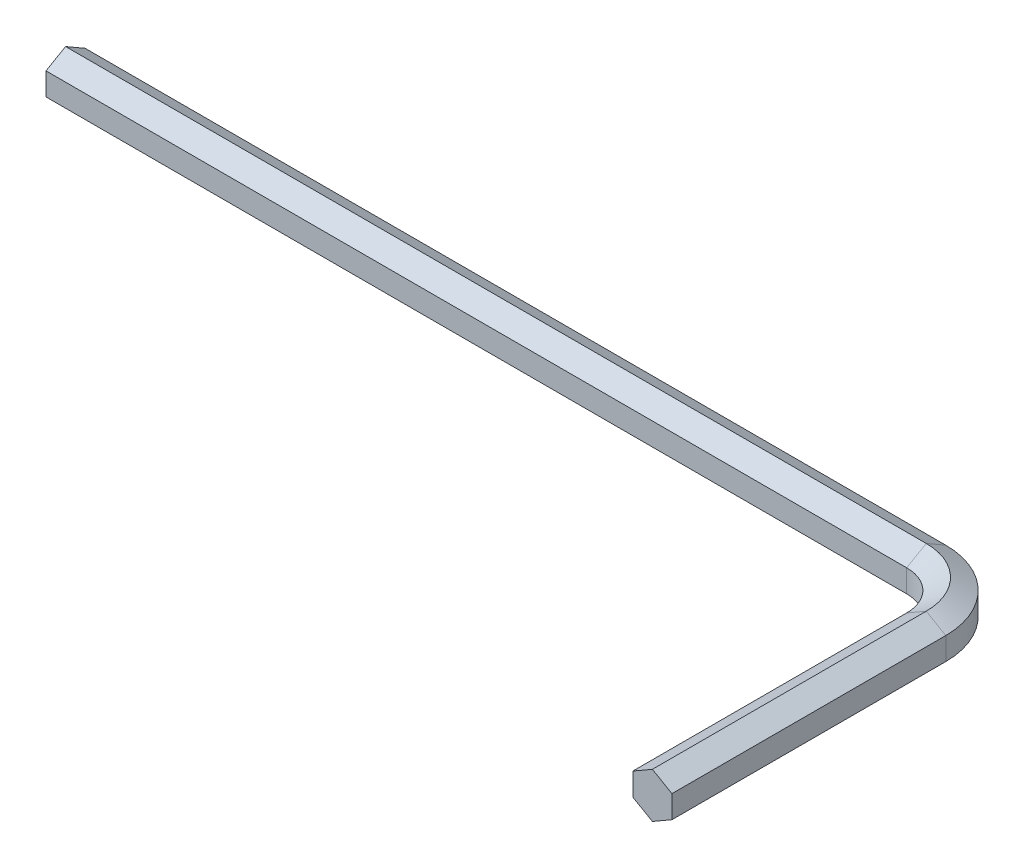
ISO-10303-21;
HEADER;
FILE_DESCRIPTION(('STEP AP214'),'2;1');
FILE_NAME('part.step','',(''),(''),'','','');
FILE_SCHEMA(('AUTOMOTIVE_DESIGN { 1 0 10303 214 1 1 1 1 }'));
ENDSEC;
DATA;
#1=APPLICATION_CONTEXT('core data for automotive mechanical design processes');
#2=APPLICATION_PROTOCOL_DEFINITION('international standard','automotive_design',2000,#1);
#3=PRODUCT_CONTEXT('',#1,'mechanical');
#4=PRODUCT('Part','Part','',(#3));
#5=PRODUCT_RELATED_PRODUCT_CATEGORY('part','',(#4));
#6=PRODUCT_DEFINITION_FORMATION('','',#4);
#7=PRODUCT_DEFINITION_CONTEXT('part definition',#1,'design');
#8=PRODUCT_DEFINITION('design','',#6,#7);
#9=PRODUCT_DEFINITION_SHAPE('','',#8);
#10=(LENGTH_UNIT() NAMED_UNIT(*) SI_UNIT(.MILLI.,.METRE.));
#11=(NAMED_UNIT(*) PLANE_ANGLE_UNIT() SI_UNIT($,.RADIAN.));
#12=(NAMED_UNIT(*) SI_UNIT($,.STERADIAN.) SOLID_ANGLE_UNIT());
#13=UNCERTAINTY_MEASURE_WITH_UNIT(LENGTH_MEASURE(1.E-05),#10,'distance_accuracy_value','');
#14=(GEOMETRIC_REPRESENTATION_CONTEXT(3) GLOBAL_UNCERTAINTY_ASSIGNED_CONTEXT((#13)) GLOBAL_UNIT_ASSIGNED_CONTEXT((#10,
#11,#12)) REPRESENTATION_CONTEXT('',''));
#15=CARTESIAN_POINT('',(0.,0.,0.));
#16=DIRECTION('',(0.,0.,1.));
#17=DIRECTION('',(1.,0.,0.));
#18=AXIS2_PLACEMENT_3D('',#15,#16,#17);
#19=CARTESIAN_POINT('',(0.,0.,0.));
#20=DIRECTION('',(0.,0.,1.));
#21=DIRECTION('',(1.,0.,0.));
#22=AXIS2_PLACEMENT_3D('',#19,#20,#21);
#23=PLANE('',#22);
#24=DIRECTION('',(-0.866025403784442,0.499999999999995,0.));
#25=VECTOR('',#24,1.);
#26=CARTESIAN_POINT('',(0.999999999999994,0.577350269189638,0.));
#27=LINE('',#26,#25);
#28=CARTESIAN_POINT('',(0.999999999999994,0.577350269189638,0.));
#29=VERTEX_POINT('',#28);
#30=CARTESIAN_POINT('',(0.,1.15470053837925,0.));
#31=VERTEX_POINT('',#30);
#32=EDGE_CURVE('E200',#29,#31,#27,.T.);
#33=ORIENTED_EDGE('',*,*,#32,.T.);
#34=DIRECTION('',(-0.866025403784438,-0.500000000000001,0.));
#35=VECTOR('',#34,1.);
#36=CARTESIAN_POINT('',(0.,1.15470053837925,0.));
#37=LINE('',#36,#35);
#38=CARTESIAN_POINT('',(-1.,0.577350269189624,0.));
#39=VERTEX_POINT('',#38);
#40=EDGE_CURVE('E154',#31,#39,#37,.T.);
#41=ORIENTED_EDGE('',*,*,#40,.T.);
#42=DIRECTION('',(0.,-1.,0.));
#43=VECTOR('',#42,1.);
#44=CARTESIAN_POINT('',(-1.,0.577350269189624,0.));
#45=LINE('',#44,#43);
#46=CARTESIAN_POINT('',(-0.999999999999998,-0.577350269189631,0.));
#47=VERTEX_POINT('',#46);
#48=EDGE_CURVE('E146',#39,#47,#45,.T.);
#49=ORIENTED_EDGE('',*,*,#48,.T.);
#50=DIRECTION('',(0.866025403784442,-0.499999999999995,0.));
#51=VECTOR('',#50,1.);
#52=CARTESIAN_POINT('',(-0.999999999999998,-0.577350269189631,0.));
#53=LINE('',#52,#51);
#54=CARTESIAN_POINT('',(0.,-1.15470053837925,0.));
#55=VERTEX_POINT('',#54);
#56=EDGE_CURVE('E139',#47,#55,#53,.T.);
#57=ORIENTED_EDGE('',*,*,#56,.T.);
#58=DIRECTION('',(0.866025403784435,0.500000000000007,0.));
#59=VECTOR('',#58,1.);
#60=CARTESIAN_POINT('',(0.,-1.15470053837925,0.));
#61=LINE('',#60,#59);
#62=CARTESIAN_POINT('',(1.00000000000001,-0.577350269189617,0.));
#63=VERTEX_POINT('',#62);
#64=EDGE_CURVE('E238',#55,#63,#61,.T.);
#65=ORIENTED_EDGE('',*,*,#64,.T.);
#66=DIRECTION('',(0.,1.,0.));
#67=VECTOR('',#66,1.);
#68=CARTESIAN_POINT('',(1.00000000000001,-0.577350269189617,0.));
#69=LINE('',#68,#67);
#70=EDGE_CURVE('E259',#63,#29,#69,.T.);
#71=ORIENTED_EDGE('',*,*,#70,.T.);
#72=EDGE_LOOP('',(#33,#41,#49,#57,#65,#71));
#73=FACE_BOUND('',#72,.T.);
#74=ADVANCED_FACE('F39',(#73),#23,.T.);
#75=CARTESIAN_POINT('',(-47.,0.,-17.));
#76=DIRECTION('',(1.,0.,0.));
#77=DIRECTION('',(0.,0.,-1.));
#78=AXIS2_PLACEMENT_3D('',#75,#76,#77);
#79=PLANE('',#78);
#80=DIRECTION('',(0.,0.499999999999995,0.866025403784442));
#81=VECTOR('',#80,1.);
#82=CARTESIAN_POINT('',(-47.,0.577350269189638,-18.));
#83=LINE('',#82,#81);
#84=CARTESIAN_POINT('',(-47.,0.577350269189638,-18.));
#85=VERTEX_POINT('',#84);
#86=CARTESIAN_POINT('',(-47.,1.15470053837925,-17.));
#87=VERTEX_POINT('',#86);
#88=EDGE_CURVE('E168',#85,#87,#83,.T.);
#89=ORIENTED_EDGE('',*,*,#88,.F.);
#90=DIRECTION('',(0.,1.,0.));
#91=VECTOR('',#90,1.);
#92=CARTESIAN_POINT('',(-47.,-0.577350269189617,-18.));
#93=LINE('',#92,#91);
#94=CARTESIAN_POINT('',(-47.,-0.577350269189617,-18.));
#95=VERTEX_POINT('',#94);
#96=EDGE_CURVE('E11',#95,#85,#93,.T.);
#97=ORIENTED_EDGE('',*,*,#96,.F.);
#98=DIRECTION('',(0.,0.500000000000007,-0.866025403784435));
#99=VECTOR('',#98,1.);
#100=CARTESIAN_POINT('',(-47.,-1.15470053837925,-17.));
#101=LINE('',#100,#99);
#102=CARTESIAN_POINT('',(-47.,-1.15470053837925,-17.));
#103=VERTEX_POINT('',#102);
#104=EDGE_CURVE('E54',#103,#95,#101,.T.);
#105=ORIENTED_EDGE('',*,*,#104,.F.);
#106=DIRECTION('',(0.,-0.499999999999995,-0.866025403784442));
#107=VECTOR('',#106,1.);
#108=CARTESIAN_POINT('',(-47.,-0.577350269189631,-16.));
#109=LINE('',#108,#107);
#110=CARTESIAN_POINT('',(-47.,-0.577350269189631,-16.));
#111=VERTEX_POINT('',#110);
#112=EDGE_CURVE('E63',#111,#103,#109,.T.);
#113=ORIENTED_EDGE('',*,*,#112,.F.);
#114=DIRECTION('',(0.,-1.,0.));
#115=VECTOR('',#114,1.);
#116=CARTESIAN_POINT('',(-47.,0.577350269189624,-16.));
#117=LINE('',#116,#115);
#118=CARTESIAN_POINT('',(-47.,0.577350269189624,-16.));
#119=VERTEX_POINT('',#118);
#120=EDGE_CURVE('E182',#119,#111,#117,.T.);
#121=ORIENTED_EDGE('',*,*,#120,.F.);
#122=DIRECTION('',(0.,-0.500000000000001,0.866025403784438));
#123=VECTOR('',#122,1.);
#124=CARTESIAN_POINT('',(-47.,1.15470053837925,-17.));
#125=LINE('',#124,#123);
#126=EDGE_CURVE('E180',#87,#119,#125,.T.);
#127=ORIENTED_EDGE('',*,*,#126,.F.);
#128=EDGE_LOOP('',(#89,#97,#105,#113,#121,#127));
#129=FACE_BOUND('',#128,.T.);
#130=ADVANCED_FACE('F181',(#129),#79,.F.);
#131=CARTESIAN_POINT('',(0.999999999999994,0.577350269189638,0.));
#132=DIRECTION('',(-0.499999999999995,-0.866025403784442,0.));
#133=DIRECTION('',(0.866025403784442,-0.499999999999995,0.));
#134=AXIS2_PLACEMENT_3D('',#131,#132,#133);
#135=PLANE('',#134);
#136=DIRECTION('',(0.,0.,-1.));
#137=VECTOR('',#136,1.);
#138=CARTESIAN_POINT('',(0.,1.15470053837925,0.));
#139=LINE('',#138,#137);
#140=CARTESIAN_POINT('',(0.,1.15470053837925,-14.));
#141=VERTEX_POINT('',#140);
#142=EDGE_CURVE('E206',#31,#141,#139,.T.);
#143=ORIENTED_EDGE('',*,*,#142,.F.);
#144=ORIENTED_EDGE('',*,*,#32,.F.);
#145=DIRECTION('',(0.,0.,-1.));
#146=VECTOR('',#145,1.);
#147=CARTESIAN_POINT('',(0.999999999999994,0.577350269189638,0.));
#148=LINE('',#147,#146);
#149=CARTESIAN_POINT('',(0.999999999999994,0.577350269189638,-14.));
#150=VERTEX_POINT('',#149);
#151=EDGE_CURVE('E282',#29,#150,#148,.T.);
#152=ORIENTED_EDGE('',*,*,#151,.T.);
#153=DIRECTION('',(-0.866025403784442,0.499999999999995,0.));
#154=VECTOR('',#153,1.);
#155=CARTESIAN_POINT('',(0.999999999999994,0.577350269189638,-14.));
#156=LINE('',#155,#154);
#157=EDGE_CURVE('E301',#150,#141,#156,.T.);
#158=ORIENTED_EDGE('',*,*,#157,.T.);
#159=EDGE_LOOP('',(#143,#144,#152,#158));
#160=FACE_BOUND('',#159,.T.);
#161=ADVANCED_FACE('F318',(#160),#135,.F.);
#162=CARTESIAN_POINT('',(0.,1.15470053837925,0.));
#163=DIRECTION('',(0.500000000000001,-0.866025403784438,0.));
#164=DIRECTION('',(0.866025403784438,0.500000000000001,0.));
#165=AXIS2_PLACEMENT_3D('',#162,#163,#164);
#166=PLANE('',#165);
#167=DIRECTION('',(0.,0.,-1.));
#168=VECTOR('',#167,1.);
#169=CARTESIAN_POINT('',(-1.,0.577350269189624,0.));
#170=LINE('',#169,#168);
#171=CARTESIAN_POINT('',(-1.,0.577350269189624,-14.));
#172=VERTEX_POINT('',#171);
#173=EDGE_CURVE('E205',#39,#172,#170,.T.);
#174=ORIENTED_EDGE('',*,*,#173,.F.);
#175=ORIENTED_EDGE('',*,*,#40,.F.);
#176=ORIENTED_EDGE('',*,*,#142,.T.);
#177=DIRECTION('',(-0.866025403784438,-0.500000000000001,0.));
#178=VECTOR('',#177,1.);
#179=CARTESIAN_POINT('',(0.,1.15470053837925,-14.));
#180=LINE('',#179,#178);
#181=EDGE_CURVE('E201',#141,#172,#180,.T.);
#182=ORIENTED_EDGE('',*,*,#181,.T.);
#183=EDGE_LOOP('',(#174,#175,#176,#182));
#184=FACE_BOUND('',#183,.T.);
#185=ADVANCED_FACE('F319',(#184),#166,.F.);
#186=CARTESIAN_POINT('',(-1.,0.577350269189624,0.));
#187=DIRECTION('',(1.,0.,0.));
#188=DIRECTION('',(0.,1.,0.));
#189=AXIS2_PLACEMENT_3D('',#186,#187,#188);
#190=PLANE('',#189);
#191=DIRECTION('',(0.,0.,-1.));
#192=VECTOR('',#191,1.);
#193=CARTESIAN_POINT('',(-0.999999999999998,-0.577350269189631,0.));
#194=LINE('',#193,#192);
#195=CARTESIAN_POINT('',(-0.999999999999998,-0.577350269189631,-14.));
#196=VERTEX_POINT('',#195);
#197=EDGE_CURVE('E223',#47,#196,#194,.T.);
#198=ORIENTED_EDGE('',*,*,#197,.F.);
#199=ORIENTED_EDGE('',*,*,#48,.F.);
#200=ORIENTED_EDGE('',*,*,#173,.T.);
#201=DIRECTION('',(0.,-1.,0.));
#202=VECTOR('',#201,1.);
#203=CARTESIAN_POINT('',(-1.,0.577350269189624,-14.));
#204=LINE('',#203,#202);
#205=EDGE_CURVE('E209',#172,#196,#204,.T.);
#206=ORIENTED_EDGE('',*,*,#205,.T.);
#207=EDGE_LOOP('',(#198,#199,#200,#206));
#208=FACE_BOUND('',#207,.T.);
#209=ADVANCED_FACE('F372',(#208),#190,.F.);
#210=CARTESIAN_POINT('',(-0.999999999999998,-0.577350269189631,0.));
#211=DIRECTION('',(0.499999999999995,0.866025403784442,0.));
#212=DIRECTION('',(-0.866025403784442,0.499999999999995,0.));
#213=AXIS2_PLACEMENT_3D('',#210,#211,#212);
#214=PLANE('',#213);
#215=DIRECTION('',(0.,0.,-1.));
#216=VECTOR('',#215,1.);
#217=CARTESIAN_POINT('',(0.,-1.15470053837925,0.));
#218=LINE('',#217,#216);
#219=CARTESIAN_POINT('',(0.,-1.15470053837925,-14.));
#220=VERTEX_POINT('',#219);
#221=EDGE_CURVE('E242',#55,#220,#218,.T.);
#222=ORIENTED_EDGE('',*,*,#221,.F.);
#223=ORIENTED_EDGE('',*,*,#56,.F.);
#224=ORIENTED_EDGE('',*,*,#197,.T.);
#225=DIRECTION('',(0.866025403784442,-0.499999999999995,0.));
#226=VECTOR('',#225,1.);
#227=CARTESIAN_POINT('',(-0.999999999999998,-0.577350269189631,-14.));
#228=LINE('',#227,#226);
#229=EDGE_CURVE('E226',#196,#220,#228,.T.);
#230=ORIENTED_EDGE('',*,*,#229,.T.);
#231=EDGE_LOOP('',(#222,#223,#224,#230));
#232=FACE_BOUND('',#231,.T.);
#233=ADVANCED_FACE('F380',(#232),#214,.F.);
#234=CARTESIAN_POINT('',(0.,-1.15470053837925,0.));
#235=DIRECTION('',(-0.500000000000007,0.866025403784435,0.));
#236=DIRECTION('',(-0.866025403784434,-0.500000000000007,0.));
#237=AXIS2_PLACEMENT_3D('',#234,#235,#236);
#238=PLANE('',#237);
#239=DIRECTION('',(0.,0.,-1.));
#240=VECTOR('',#239,1.);
#241=CARTESIAN_POINT('',(1.00000000000001,-0.577350269189617,0.));
#242=LINE('',#241,#240);
#243=CARTESIAN_POINT('',(1.00000000000001,-0.577350269189617,-14.));
#244=VERTEX_POINT('',#243);
#245=EDGE_CURVE('E263',#63,#244,#242,.T.);
#246=ORIENTED_EDGE('',*,*,#245,.F.);
#247=ORIENTED_EDGE('',*,*,#64,.F.);
#248=ORIENTED_EDGE('',*,*,#221,.T.);
#249=DIRECTION('',(0.866025403784435,0.500000000000007,0.));
#250=VECTOR('',#249,1.);
#251=CARTESIAN_POINT('',(0.,-1.15470053837925,-14.));
#252=LINE('',#251,#250);
#253=EDGE_CURVE('E246',#220,#244,#252,.T.);
#254=ORIENTED_EDGE('',*,*,#253,.T.);
#255=EDGE_LOOP('',(#246,#247,#248,#254));
#256=FACE_BOUND('',#255,.T.);
#257=ADVANCED_FACE('F389',(#256),#238,.F.);
#258=CARTESIAN_POINT('',(1.00000000000001,-0.577350269189617,0.));
#259=DIRECTION('',(-1.,0.,0.));
#260=DIRECTION('',(0.,-1.,0.));
#261=AXIS2_PLACEMENT_3D('',#258,#259,#260);
#262=PLANE('',#261);
#263=DIRECTION('',(0.,1.,0.));
#264=VECTOR('',#263,1.);
#265=CARTESIAN_POINT('',(1.00000000000001,-0.577350269189617,-14.));
#266=LINE('',#265,#264);
#267=EDGE_CURVE('E267',#244,#150,#266,.T.);
#268=ORIENTED_EDGE('',*,*,#267,.T.);
#269=ORIENTED_EDGE('',*,*,#151,.F.);
#270=ORIENTED_EDGE('',*,*,#70,.F.);
#271=ORIENTED_EDGE('',*,*,#245,.T.);
#272=EDGE_LOOP('',(#268,#269,#270,#271));
#273=FACE_BOUND('',#272,.T.);
#274=ADVANCED_FACE('F330',(#273),#262,.F.);
#275=CARTESIAN_POINT('',(-3.,0.577350269189638,-14.));
#276=DIRECTION('',(0.,-1.,0.));
#277=DIRECTION('',(0.,0.,-1.));
#278=AXIS2_PLACEMENT_3D('',#275,#276,#277);
#279=CONICAL_SURFACE('',#278,3.99999999999999,1.0471975511966);
#280=CARTESIAN_POINT('',(-3.,1.15470053837925,-14.));
#281=DIRECTION('',(0.,1.,0.));
#282=DIRECTION('',(1.,0.,0.));
#283=AXIS2_PLACEMENT_3D('',#280,#281,#282);
#284=CIRCLE('',#283,3.);
#285=CARTESIAN_POINT('',(-3.00000000000002,1.15470053837925,-17.));
#286=VERTEX_POINT('',#285);
#287=EDGE_CURVE('E212',#141,#286,#284,.T.);
#288=ORIENTED_EDGE('',*,*,#287,.F.);
#289=ORIENTED_EDGE('',*,*,#157,.F.);
#290=CARTESIAN_POINT('',(-3.,0.577350269189638,-14.));
#291=DIRECTION('',(0.,1.,0.));
#292=DIRECTION('',(1.,0.,0.));
#293=AXIS2_PLACEMENT_3D('',#290,#291,#292);
#294=CIRCLE('',#293,3.99999999999999);
#295=CARTESIAN_POINT('',(-3.00000000000003,0.577350269189638,-18.));
#296=VERTEX_POINT('',#295);
#297=EDGE_CURVE('E285',#150,#296,#294,.T.);
#298=ORIENTED_EDGE('',*,*,#297,.T.);
#299=DIRECTION('',(0.,0.499999999999995,0.866025403784442));
#300=VECTOR('',#299,1.);
#301=CARTESIAN_POINT('',(-3.00000000000003,0.577350269189638,-18.));
#302=LINE('',#301,#300);
#303=EDGE_CURVE('E294',#296,#286,#302,.T.);
#304=ORIENTED_EDGE('',*,*,#303,.T.);
#305=EDGE_LOOP('',(#288,#289,#298,#304));
#306=FACE_BOUND('',#305,.T.);
#307=ADVANCED_FACE('F299',(#306),#279,.T.);
#308=CARTESIAN_POINT('',(-3.,1.15470053837925,-14.));
#309=DIRECTION('',(0.,1.,0.));
#310=DIRECTION('',(0.,0.,1.));
#311=AXIS2_PLACEMENT_3D('',#308,#309,#310);
#312=CONICAL_SURFACE('',#311,3.,1.0471975511966);
#313=CARTESIAN_POINT('',(-3.,0.577350269189624,-14.));
#314=DIRECTION('',(0.,1.,0.));
#315=DIRECTION('',(1.,0.,0.));
#316=AXIS2_PLACEMENT_3D('',#313,#314,#315);
#317=CIRCLE('',#316,2.);
#318=CARTESIAN_POINT('',(-3.00000000000001,0.577350269189624,-16.));
#319=VERTEX_POINT('',#318);
#320=EDGE_CURVE('E126',#172,#319,#317,.T.);
#321=ORIENTED_EDGE('',*,*,#320,.F.);
#322=ORIENTED_EDGE('',*,*,#181,.F.);
#323=ORIENTED_EDGE('',*,*,#287,.T.);
#324=DIRECTION('',(0.,-0.500000000000001,0.866025403784438));
#325=VECTOR('',#324,1.);
#326=CARTESIAN_POINT('',(-3.00000000000002,1.15470053837925,-17.));
#327=LINE('',#326,#325);
#328=EDGE_CURVE('E189',#286,#319,#327,.T.);
#329=ORIENTED_EDGE('',*,*,#328,.T.);
#330=EDGE_LOOP('',(#321,#322,#323,#329));
#331=FACE_BOUND('',#330,.T.);
#332=ADVANCED_FACE('F320',(#331),#312,.F.);
#333=CARTESIAN_POINT('',(-3.,0.,-14.));
#334=DIRECTION('',(0.,1.,0.));
#335=DIRECTION('',(0.,0.,1.));
#336=AXIS2_PLACEMENT_3D('',#333,#334,#335);
#337=CYLINDRICAL_SURFACE('',#336,2.);
#338=CARTESIAN_POINT('',(-3.,-0.577350269189631,-14.));
#339=DIRECTION('',(0.,1.,0.));
#340=DIRECTION('',(1.,0.,0.));
#341=AXIS2_PLACEMENT_3D('',#338,#339,#340);
#342=CIRCLE('',#341,2.);
#343=CARTESIAN_POINT('',(-3.00000000000001,-0.577350269189631,-16.));
#344=VERTEX_POINT('',#343);
#345=EDGE_CURVE('E118',#196,#344,#342,.T.);
#346=ORIENTED_EDGE('',*,*,#345,.F.);
#347=ORIENTED_EDGE('',*,*,#205,.F.);
#348=ORIENTED_EDGE('',*,*,#320,.T.);
#349=DIRECTION('',(0.,-1.,0.));
#350=VECTOR('',#349,1.);
#351=CARTESIAN_POINT('',(-3.00000000000001,0.577350269189624,-16.));
#352=LINE('',#351,#350);
#353=EDGE_CURVE('E214',#319,#344,#352,.T.);
#354=ORIENTED_EDGE('',*,*,#353,.T.);
#355=EDGE_LOOP('',(#346,#347,#348,#354));
#356=FACE_BOUND('',#355,.T.);
#357=ADVANCED_FACE('F322',(#356),#337,.F.);
#358=CARTESIAN_POINT('',(-3.,-0.577350269189631,-14.));
#359=DIRECTION('',(0.,-1.,0.));
#360=DIRECTION('',(0.,0.,-1.));
#361=AXIS2_PLACEMENT_3D('',#358,#359,#360);
#362=CONICAL_SURFACE('',#361,2.,1.0471975511966);
#363=CARTESIAN_POINT('',(-3.,-1.15470053837925,-14.));
#364=DIRECTION('',(0.,1.,0.));
#365=DIRECTION('',(1.,0.,0.));
#366=AXIS2_PLACEMENT_3D('',#363,#364,#365);
#367=CIRCLE('',#366,3.00000000000001);
#368=CARTESIAN_POINT('',(-3.00000000000002,-1.15470053837925,-17.));
#369=VERTEX_POINT('',#368);
#370=EDGE_CURVE('E110',#220,#369,#367,.T.);
#371=ORIENTED_EDGE('',*,*,#370,.F.);
#372=ORIENTED_EDGE('',*,*,#229,.F.);
#373=ORIENTED_EDGE('',*,*,#345,.T.);
#374=DIRECTION('',(0.,-0.499999999999995,-0.866025403784442));
#375=VECTOR('',#374,1.);
#376=CARTESIAN_POINT('',(-3.00000000000001,-0.577350269189631,-16.));
#377=LINE('',#376,#375);
#378=EDGE_CURVE('E231',#344,#369,#377,.T.);
#379=ORIENTED_EDGE('',*,*,#378,.T.);
#380=EDGE_LOOP('',(#371,#372,#373,#379));
#381=FACE_BOUND('',#380,.T.);
#382=ADVANCED_FACE('F328',(#381),#362,.F.);
#383=CARTESIAN_POINT('',(-3.,-1.15470053837925,-14.));
#384=DIRECTION('',(0.,1.,0.));
#385=DIRECTION('',(0.,0.,1.));
#386=AXIS2_PLACEMENT_3D('',#383,#384,#385);
#387=CONICAL_SURFACE('',#386,3.00000000000001,1.04719755119659);
#388=CARTESIAN_POINT('',(-3.,-0.577350269189617,-14.));
#389=DIRECTION('',(0.,1.,0.));
#390=DIRECTION('',(1.,0.,0.));
#391=AXIS2_PLACEMENT_3D('',#388,#389,#390);
#392=CIRCLE('',#391,4.00000000000001);
#393=CARTESIAN_POINT('',(-3.00000000000003,-0.577350269189617,-18.));
#394=VERTEX_POINT('',#393);
#395=EDGE_CURVE('E271',#244,#394,#392,.T.);
#396=ORIENTED_EDGE('',*,*,#395,.F.);
#397=ORIENTED_EDGE('',*,*,#253,.F.);
#398=ORIENTED_EDGE('',*,*,#370,.T.);
#399=DIRECTION('',(0.,0.500000000000007,-0.866025403784435));
#400=VECTOR('',#399,1.);
#401=CARTESIAN_POINT('',(-3.00000000000002,-1.15470053837925,-17.));
#402=LINE('',#401,#400);
#403=EDGE_CURVE('E251',#369,#394,#402,.T.);
#404=ORIENTED_EDGE('',*,*,#403,.T.);
#405=EDGE_LOOP('',(#396,#397,#398,#404));
#406=FACE_BOUND('',#405,.T.);
#407=ADVANCED_FACE('F431',(#406),#387,.T.);
#408=CARTESIAN_POINT('',(-3.,0.,-14.));
#409=DIRECTION('',(0.,1.,0.));
#410=DIRECTION('',(0.,0.,1.));
#411=AXIS2_PLACEMENT_3D('',#408,#409,#410);
#412=CYLINDRICAL_SURFACE('',#411,4.);
#413=DIRECTION('',(0.,1.,0.));
#414=VECTOR('',#413,1.);
#415=CARTESIAN_POINT('',(-3.00000000000003,-0.577350269189617,-18.));
#416=LINE('',#415,#414);
#417=EDGE_CURVE('E197',#394,#296,#416,.T.);
#418=ORIENTED_EDGE('',*,*,#417,.T.);
#419=ORIENTED_EDGE('',*,*,#297,.F.);
#420=ORIENTED_EDGE('',*,*,#267,.F.);
#421=ORIENTED_EDGE('',*,*,#395,.T.);
#422=EDGE_LOOP('',(#418,#419,#420,#421));
#423=FACE_BOUND('',#422,.T.);
#424=ADVANCED_FACE('F289',(#423),#412,.T.);
#425=CARTESIAN_POINT('',(-3.00000000000002,0.577350269189638,-18.));
#426=DIRECTION('',(0.,-0.866025403784442,0.499999999999995));
#427=DIRECTION('',(0.,-0.499999999999995,-0.866025403784442));
#428=AXIS2_PLACEMENT_3D('',#425,#426,#427);
#429=PLANE('',#428);
#430=DIRECTION('',(-1.,0.,0.));
#431=VECTOR('',#430,1.);
#432=CARTESIAN_POINT('',(-3.00000000000002,1.15470053837925,-17.));
#433=LINE('',#432,#431);
#434=EDGE_CURVE('E173',#286,#87,#433,.T.);
#435=ORIENTED_EDGE('',*,*,#434,.F.);
#436=ORIENTED_EDGE('',*,*,#303,.F.);
#437=DIRECTION('',(-1.,0.,0.));
#438=VECTOR('',#437,1.);
#439=CARTESIAN_POINT('',(-3.00000000000002,0.577350269189638,-18.));
#440=LINE('',#439,#438);
#441=EDGE_CURVE('E175',#296,#85,#440,.T.);
#442=ORIENTED_EDGE('',*,*,#441,.T.);
#443=ORIENTED_EDGE('',*,*,#88,.T.);
#444=EDGE_LOOP('',(#435,#436,#442,#443));
#445=FACE_BOUND('',#444,.T.);
#446=ADVANCED_FACE('F170',(#445),#429,.F.);
#447=CARTESIAN_POINT('',(-3.00000000000002,1.15470053837925,-17.));
#448=DIRECTION('',(0.,-0.866025403784438,-0.500000000000001));
#449=DIRECTION('',(0.,0.500000000000001,-0.866025403784438));
#450=AXIS2_PLACEMENT_3D('',#447,#448,#449);
#451=PLANE('',#450);
#452=DIRECTION('',(-1.,0.,0.));
#453=VECTOR('',#452,1.);
#454=CARTESIAN_POINT('',(-3.00000000000002,0.577350269189624,-16.));
#455=LINE('',#454,#453);
#456=EDGE_CURVE('E186',#319,#119,#455,.T.);
#457=ORIENTED_EDGE('',*,*,#456,.F.);
#458=ORIENTED_EDGE('',*,*,#328,.F.);
#459=ORIENTED_EDGE('',*,*,#434,.T.);
#460=ORIENTED_EDGE('',*,*,#126,.T.);
#461=EDGE_LOOP('',(#457,#458,#459,#460));
#462=FACE_BOUND('',#461,.T.);
#463=ADVANCED_FACE('F188',(#462),#451,.F.);
#464=CARTESIAN_POINT('',(-3.00000000000002,0.577350269189624,-16.));
#465=DIRECTION('',(0.,0.,-1.));
#466=DIRECTION('',(0.,1.,0.));
#467=AXIS2_PLACEMENT_3D('',#464,#465,#466);
#468=PLANE('',#467);
#469=DIRECTION('',(-1.,0.,0.));
#470=VECTOR('',#469,1.);
#471=CARTESIAN_POINT('',(-3.00000000000002,-0.577350269189631,-16.));
#472=LINE('',#471,#470);
#473=EDGE_CURVE('E95',#344,#111,#472,.T.);
#474=ORIENTED_EDGE('',*,*,#473,.F.);
#475=ORIENTED_EDGE('',*,*,#353,.F.);
#476=ORIENTED_EDGE('',*,*,#456,.T.);
#477=ORIENTED_EDGE('',*,*,#120,.T.);
#478=EDGE_LOOP('',(#474,#475,#476,#477));
#479=FACE_BOUND('',#478,.T.);
#480=ADVANCED_FACE('F464',(#479),#468,.F.);
#481=CARTESIAN_POINT('',(-3.00000000000002,-0.577350269189631,-16.));
#482=DIRECTION('',(0.,0.866025403784442,-0.499999999999995));
#483=DIRECTION('',(0.,0.499999999999995,0.866025403784442));
#484=AXIS2_PLACEMENT_3D('',#481,#482,#483);
#485=PLANE('',#484);
#486=DIRECTION('',(-1.,0.,0.));
#487=VECTOR('',#486,1.);
#488=CARTESIAN_POINT('',(-3.00000000000002,-1.15470053837925,-17.));
#489=LINE('',#488,#487);
#490=EDGE_CURVE('E89',#369,#103,#489,.T.);
#491=ORIENTED_EDGE('',*,*,#490,.F.);
#492=ORIENTED_EDGE('',*,*,#378,.F.);
#493=ORIENTED_EDGE('',*,*,#473,.T.);
#494=ORIENTED_EDGE('',*,*,#112,.T.);
#495=EDGE_LOOP('',(#491,#492,#493,#494));
#496=FACE_BOUND('',#495,.T.);
#497=ADVANCED_FACE('F341',(#496),#485,.F.);
#498=CARTESIAN_POINT('',(-3.00000000000002,-1.15470053837925,-17.));
#499=DIRECTION('',(0.,0.866025403784435,0.500000000000007));
#500=DIRECTION('',(0.,-0.500000000000007,0.866025403784434));
#501=AXIS2_PLACEMENT_3D('',#498,#499,#500);
#502=PLANE('',#501);
#503=DIRECTION('',(-1.,0.,0.));
#504=VECTOR('',#503,1.);
#505=CARTESIAN_POINT('',(-3.00000000000002,-0.577350269189617,-18.));
#506=LINE('',#505,#504);
#507=EDGE_CURVE('E47',#394,#95,#506,.T.);
#508=ORIENTED_EDGE('',*,*,#507,.F.);
#509=ORIENTED_EDGE('',*,*,#403,.F.);
#510=ORIENTED_EDGE('',*,*,#490,.T.);
#511=ORIENTED_EDGE('',*,*,#104,.T.);
#512=EDGE_LOOP('',(#508,#509,#510,#511));
#513=FACE_BOUND('',#512,.T.);
#514=ADVANCED_FACE('F336',(#513),#502,.F.);
#515=CARTESIAN_POINT('',(-3.00000000000002,-0.577350269189617,-18.));
#516=DIRECTION('',(0.,0.,1.));
#517=DIRECTION('',(0.,-1.,0.));
#518=AXIS2_PLACEMENT_3D('',#515,#516,#517);
#519=PLANE('',#518);
#520=ORIENTED_EDGE('',*,*,#96,.T.);
#521=ORIENTED_EDGE('',*,*,#441,.F.);
#522=ORIENTED_EDGE('',*,*,#417,.F.);
#523=ORIENTED_EDGE('',*,*,#507,.T.);
#524=EDGE_LOOP('',(#520,#521,#522,#523));
#525=FACE_BOUND('',#524,.T.);
#526=ADVANCED_FACE('F334',(#525),#519,.F.);
#527=CLOSED_SHELL('',(#74,#130,#161,#185,#209,#233,#257,#274,#307,#332,#357,#382,#407,#424,#446,
#463,#480,#497,#514,#526));
#528=MANIFOLD_SOLID_BREP('B2',#527);
#529=ADVANCED_BREP_SHAPE_REPRESENTATION('',(#18,#528),#14);
#530=SHAPE_DEFINITION_REPRESENTATION(#9,#529);
ENDSEC;
END-ISO-10303-21;
